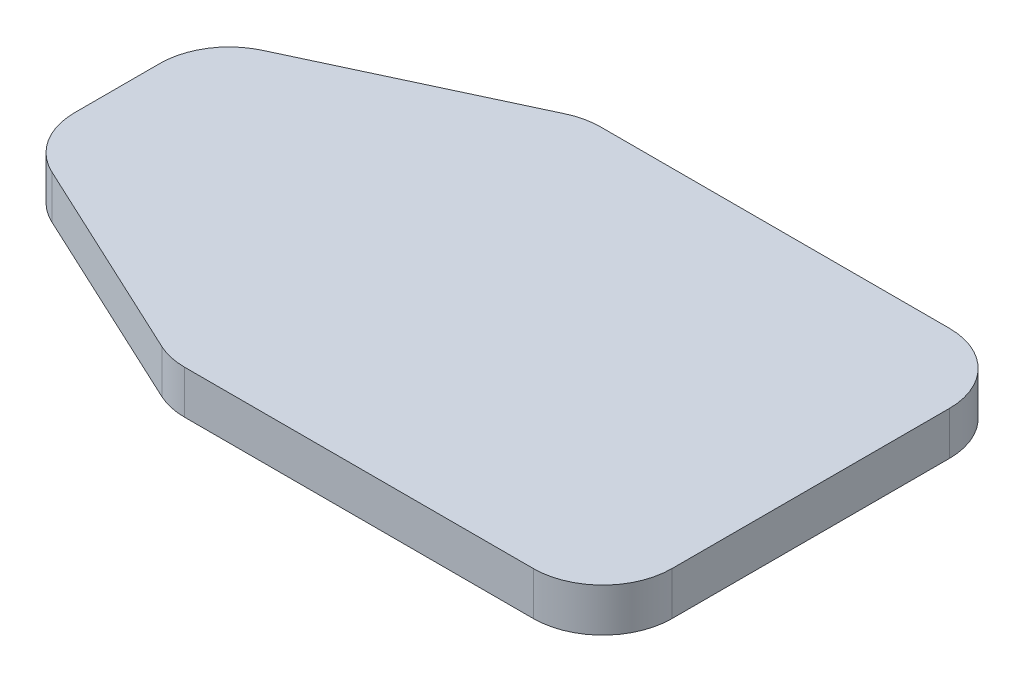
ISO-10303-21;
HEADER;
FILE_DESCRIPTION(('STEP AP214'),'2;1');
FILE_NAME('part.step','',(''),(''),'','','');
FILE_SCHEMA(('AUTOMOTIVE_DESIGN { 1 0 10303 214 1 1 1 1 }'));
ENDSEC;
DATA;
#1=APPLICATION_CONTEXT('core data for automotive mechanical design processes');
#2=APPLICATION_PROTOCOL_DEFINITION('international standard','automotive_design',2000,#1);
#3=PRODUCT_CONTEXT('',#1,'mechanical');
#4=PRODUCT('Part','Part','',(#3));
#5=PRODUCT_RELATED_PRODUCT_CATEGORY('part','',(#4));
#6=PRODUCT_DEFINITION_FORMATION('','',#4);
#7=PRODUCT_DEFINITION_CONTEXT('part definition',#1,'design');
#8=PRODUCT_DEFINITION('design','',#6,#7);
#9=PRODUCT_DEFINITION_SHAPE('','',#8);
#10=(LENGTH_UNIT() NAMED_UNIT(*) SI_UNIT(.MILLI.,.METRE.));
#11=(NAMED_UNIT(*) PLANE_ANGLE_UNIT() SI_UNIT($,.RADIAN.));
#12=(NAMED_UNIT(*) SI_UNIT($,.STERADIAN.) SOLID_ANGLE_UNIT());
#13=UNCERTAINTY_MEASURE_WITH_UNIT(LENGTH_MEASURE(1.E-05),#10,'distance_accuracy_value','');
#14=(GEOMETRIC_REPRESENTATION_CONTEXT(3) GLOBAL_UNCERTAINTY_ASSIGNED_CONTEXT((#13)) GLOBAL_UNIT_ASSIGNED_CONTEXT((#10,
#11,#12)) REPRESENTATION_CONTEXT('',''));
#15=CARTESIAN_POINT('',(0.,0.,0.));
#16=DIRECTION('',(0.,0.,1.));
#17=DIRECTION('',(1.,0.,0.));
#18=AXIS2_PLACEMENT_3D('',#15,#16,#17);
#19=CARTESIAN_POINT('',(-25.4,3.175,0.));
#20=DIRECTION('',(1.,0.,0.));
#21=DIRECTION('',(0.,0.,-1.));
#22=AXIS2_PLACEMENT_3D('',#19,#20,#21);
#23=PLANE('',#22);
#24=DIRECTION('',(0.,0.,1.));
#25=VECTOR('',#24,1.);
#26=CARTESIAN_POINT('',(-25.4,3.175,0.));
#27=LINE('',#26,#25);
#28=CARTESIAN_POINT('',(-25.4,3.175,-3.11473583901241));
#29=VERTEX_POINT('',#28);
#30=CARTESIAN_POINT('',(-25.4,3.175,3.1147358390124));
#31=VERTEX_POINT('',#30);
#32=EDGE_CURVE('E148',#29,#31,#27,.T.);
#33=ORIENTED_EDGE('',*,*,#32,.F.);
#34=DIRECTION('',(0.,-1.,0.));
#35=VECTOR('',#34,1.);
#36=CARTESIAN_POINT('',(-25.4,0.,-3.11473583901241));
#37=LINE('',#36,#35);
#38=CARTESIAN_POINT('',(-25.4,0.,-3.11473583901241));
#39=VERTEX_POINT('',#38);
#40=EDGE_CURVE('E186',#29,#39,#37,.T.);
#41=ORIENTED_EDGE('',*,*,#40,.T.);
#42=DIRECTION('',(0.,0.,1.));
#43=VECTOR('',#42,1.);
#44=CARTESIAN_POINT('',(-25.4,0.,0.));
#45=LINE('',#44,#43);
#46=CARTESIAN_POINT('',(-25.4,0.,3.1147358390124));
#47=VERTEX_POINT('',#46);
#48=EDGE_CURVE('E132',#39,#47,#45,.T.);
#49=ORIENTED_EDGE('',*,*,#48,.T.);
#50=DIRECTION('',(0.,-1.,0.));
#51=VECTOR('',#50,1.);
#52=CARTESIAN_POINT('',(-25.4,3.175,3.1147358390124));
#53=LINE('',#52,#51);
#54=EDGE_CURVE('E184',#47,#31,#53,.F.);
#55=ORIENTED_EDGE('',*,*,#54,.T.);
#56=EDGE_LOOP('',(#33,#41,#49,#55));
#57=FACE_BOUND('',#56,.T.);
#58=ADVANCED_FACE('F36',(#57),#23,.F.);
#59=CARTESIAN_POINT('',(-6.9757299270073,3.175,14.9479927007299));
#60=DIRECTION('',(0.422885465331124,0.,-0.906183139995265));
#61=DIRECTION('',(-0.906183139995265,0.,-0.422885465331124));
#62=AXIS2_PLACEMENT_3D('',#59,#60,#61);
#63=PLANE('',#62);
#64=DIRECTION('',(0.906183139995265,0.,0.422885465331124));
#65=VECTOR('',#64,1.);
#66=CARTESIAN_POINT('',(-6.9757299270073,3.175,14.9479927007299));
#67=LINE('',#66,#65);
#68=CARTESIAN_POINT('',(-22.4682581638821,3.175,7.71814619018835));
#69=VERTEX_POINT('',#68);
#70=CARTESIAN_POINT('',(-7.37126353319441,3.175,14.7634103511759));
#71=VERTEX_POINT('',#70);
#72=EDGE_CURVE('E202',#69,#71,#67,.T.);
#73=ORIENTED_EDGE('',*,*,#72,.F.);
#74=DIRECTION('',(0.,-1.,0.));
#75=VECTOR('',#74,1.);
#76=CARTESIAN_POINT('',(-22.4682581638821,3.175,7.71814619018835));
#77=LINE('',#76,#75);
#78=CARTESIAN_POINT('',(-22.4682581638821,0.,7.71814619018835));
#79=VERTEX_POINT('',#78);
#80=EDGE_CURVE('E11',#69,#79,#77,.T.);
#81=ORIENTED_EDGE('',*,*,#80,.T.);
#82=DIRECTION('',(0.906183139995265,0.,0.422885465331124));
#83=VECTOR('',#82,1.);
#84=CARTESIAN_POINT('',(-6.9757299270073,0.,14.9479927007299));
#85=LINE('',#84,#83);
#86=CARTESIAN_POINT('',(-7.37126353319441,0.,14.7634103511759));
#87=VERTEX_POINT('',#86);
#88=EDGE_CURVE('E205',#79,#87,#85,.T.);
#89=ORIENTED_EDGE('',*,*,#88,.T.);
#90=DIRECTION('',(0.,-1.,0.));
#91=VECTOR('',#90,1.);
#92=CARTESIAN_POINT('',(-7.37126353319441,3.175,14.7634103511759));
#93=LINE('',#92,#91);
#94=EDGE_CURVE('E44',#87,#71,#93,.F.);
#95=ORIENTED_EDGE('',*,*,#94,.T.);
#96=EDGE_LOOP('',(#73,#81,#89,#95));
#97=FACE_BOUND('',#96,.T.);
#98=ADVANCED_FACE('F201',(#97),#63,.F.);
#99=CARTESIAN_POINT('',(0.,3.175,15.24));
#100=DIRECTION('',(0.,0.,-1.));
#101=DIRECTION('',(-1.,0.,0.));
#102=AXIS2_PLACEMENT_3D('',#99,#100,#101);
#103=PLANE('',#102);
#104=DIRECTION('',(1.,0.,0.));
#105=VECTOR('',#104,1.);
#106=CARTESIAN_POINT('',(0.,0.,15.24));
#107=LINE('',#106,#105);
#108=CARTESIAN_POINT('',(-5.2230053693123,0.,15.24));
#109=VERTEX_POINT('',#108);
#110=CARTESIAN_POINT('',(20.32,0.,15.24));
#111=VERTEX_POINT('',#110);
#112=EDGE_CURVE('E220',#109,#111,#107,.T.);
#113=ORIENTED_EDGE('',*,*,#112,.T.);
#114=DIRECTION('',(0.,-1.,0.));
#115=VECTOR('',#114,1.);
#116=CARTESIAN_POINT('',(20.32,3.175,15.24));
#117=LINE('',#116,#115);
#118=CARTESIAN_POINT('',(20.32,3.175,15.24));
#119=VERTEX_POINT('',#118);
#120=EDGE_CURVE('E195',#111,#119,#117,.F.);
#121=ORIENTED_EDGE('',*,*,#120,.T.);
#122=DIRECTION('',(1.,0.,0.));
#123=VECTOR('',#122,1.);
#124=CARTESIAN_POINT('',(0.,3.175,15.24));
#125=LINE('',#124,#123);
#126=CARTESIAN_POINT('',(-5.2230053693123,3.175,15.24));
#127=VERTEX_POINT('',#126);
#128=EDGE_CURVE('E213',#127,#119,#125,.T.);
#129=ORIENTED_EDGE('',*,*,#128,.F.);
#130=DIRECTION('',(0.,-1.,0.));
#131=VECTOR('',#130,1.);
#132=CARTESIAN_POINT('',(-5.2230053693123,3.175,15.24));
#133=LINE('',#132,#131);
#134=EDGE_CURVE('E192',#127,#109,#133,.T.);
#135=ORIENTED_EDGE('',*,*,#134,.T.);
#136=EDGE_LOOP('',(#113,#121,#129,#135));
#137=FACE_BOUND('',#136,.T.);
#138=ADVANCED_FACE('F219',(#137),#103,.F.);
#139=CARTESIAN_POINT('',(25.4,3.175,0.));
#140=DIRECTION('',(1.,0.,0.));
#141=DIRECTION('',(0.,0.,-1.));
#142=AXIS2_PLACEMENT_3D('',#139,#140,#141);
#143=PLANE('',#142);
#144=DIRECTION('',(0.,0.,1.));
#145=VECTOR('',#144,1.);
#146=CARTESIAN_POINT('',(25.4,3.175,0.));
#147=LINE('',#146,#145);
#148=CARTESIAN_POINT('',(25.4,3.175,-10.16));
#149=VERTEX_POINT('',#148);
#150=CARTESIAN_POINT('',(25.4,3.175,10.16));
#151=VERTEX_POINT('',#150);
#152=EDGE_CURVE('E239',#149,#151,#147,.T.);
#153=ORIENTED_EDGE('',*,*,#152,.T.);
#154=DIRECTION('',(0.,-1.,0.));
#155=VECTOR('',#154,1.);
#156=CARTESIAN_POINT('',(25.4,0.,10.16));
#157=LINE('',#156,#155);
#158=CARTESIAN_POINT('',(25.4,0.,10.16));
#159=VERTEX_POINT('',#158);
#160=EDGE_CURVE('E189',#151,#159,#157,.T.);
#161=ORIENTED_EDGE('',*,*,#160,.T.);
#162=DIRECTION('',(0.,0.,1.));
#163=VECTOR('',#162,1.);
#164=CARTESIAN_POINT('',(25.4,0.,0.));
#165=LINE('',#164,#163);
#166=CARTESIAN_POINT('',(25.4,0.,-10.16));
#167=VERTEX_POINT('',#166);
#168=EDGE_CURVE('E223',#167,#159,#165,.T.);
#169=ORIENTED_EDGE('',*,*,#168,.F.);
#170=DIRECTION('',(0.,-1.,0.));
#171=VECTOR('',#170,1.);
#172=CARTESIAN_POINT('',(25.4,3.175,-10.16));
#173=LINE('',#172,#171);
#174=EDGE_CURVE('E58',#167,#149,#173,.F.);
#175=ORIENTED_EDGE('',*,*,#174,.T.);
#176=EDGE_LOOP('',(#153,#161,#169,#175));
#177=FACE_BOUND('',#176,.T.);
#178=ADVANCED_FACE('F274',(#177),#143,.T.);
#179=CARTESIAN_POINT('',(0.,3.175,-15.24));
#180=DIRECTION('',(0.,0.,-1.));
#181=DIRECTION('',(-1.,0.,0.));
#182=AXIS2_PLACEMENT_3D('',#179,#180,#181);
#183=PLANE('',#182);
#184=DIRECTION('',(1.,0.,0.));
#185=VECTOR('',#184,1.);
#186=CARTESIAN_POINT('',(0.,0.,-15.24));
#187=LINE('',#186,#185);
#188=CARTESIAN_POINT('',(-5.2230053693123,0.,-15.24));
#189=VERTEX_POINT('',#188);
#190=CARTESIAN_POINT('',(20.32,0.,-15.24));
#191=VERTEX_POINT('',#190);
#192=EDGE_CURVE('E149',#189,#191,#187,.T.);
#193=ORIENTED_EDGE('',*,*,#192,.F.);
#194=DIRECTION('',(0.,-1.,0.));
#195=VECTOR('',#194,1.);
#196=CARTESIAN_POINT('',(-5.2230053693123,3.175,-15.24));
#197=LINE('',#196,#195);
#198=CARTESIAN_POINT('',(-5.2230053693123,3.175,-15.24));
#199=VERTEX_POINT('',#198);
#200=EDGE_CURVE('E172',#189,#199,#197,.F.);
#201=ORIENTED_EDGE('',*,*,#200,.T.);
#202=DIRECTION('',(1.,0.,0.));
#203=VECTOR('',#202,1.);
#204=CARTESIAN_POINT('',(0.,3.175,-15.24));
#205=LINE('',#204,#203);
#206=CARTESIAN_POINT('',(20.32,3.175,-15.24));
#207=VERTEX_POINT('',#206);
#208=EDGE_CURVE('E158',#199,#207,#205,.T.);
#209=ORIENTED_EDGE('',*,*,#208,.T.);
#210=DIRECTION('',(0.,-1.,0.));
#211=VECTOR('',#210,1.);
#212=CARTESIAN_POINT('',(20.32,3.175,-15.24));
#213=LINE('',#212,#211);
#214=EDGE_CURVE('E169',#207,#191,#213,.T.);
#215=ORIENTED_EDGE('',*,*,#214,.T.);
#216=EDGE_LOOP('',(#193,#201,#209,#215));
#217=FACE_BOUND('',#216,.T.);
#218=ADVANCED_FACE('F232',(#217),#183,.T.);
#219=CARTESIAN_POINT('',(-6.9757299270073,3.175,-14.9479927007299));
#220=DIRECTION('',(-0.422885465331124,0.,-0.906183139995265));
#221=DIRECTION('',(-0.906183139995265,0.,0.422885465331124));
#222=AXIS2_PLACEMENT_3D('',#219,#220,#221);
#223=PLANE('',#222);
#224=DIRECTION('',(0.906183139995265,0.,-0.422885465331124));
#225=VECTOR('',#224,1.);
#226=CARTESIAN_POINT('',(-6.9757299270073,3.175,-14.9479927007299));
#227=LINE('',#226,#225);
#228=CARTESIAN_POINT('',(-22.4682581638821,3.175,-7.71814619018835));
#229=VERTEX_POINT('',#228);
#230=CARTESIAN_POINT('',(-7.37126353319441,3.175,-14.7634103511759));
#231=VERTEX_POINT('',#230);
#232=EDGE_CURVE('E154',#229,#231,#227,.T.);
#233=ORIENTED_EDGE('',*,*,#232,.T.);
#234=DIRECTION('',(0.,-1.,0.));
#235=VECTOR('',#234,1.);
#236=CARTESIAN_POINT('',(-7.37126353319441,3.175,-14.7634103511759));
#237=LINE('',#236,#235);
#238=CARTESIAN_POINT('',(-7.37126353319441,0.,-14.7634103511759));
#239=VERTEX_POINT('',#238);
#240=EDGE_CURVE('E147',#231,#239,#237,.T.);
#241=ORIENTED_EDGE('',*,*,#240,.T.);
#242=DIRECTION('',(0.906183139995265,0.,-0.422885465331124));
#243=VECTOR('',#242,1.);
#244=CARTESIAN_POINT('',(-6.9757299270073,0.,-14.9479927007299));
#245=LINE('',#244,#243);
#246=CARTESIAN_POINT('',(-22.4682581638821,0.,-7.71814619018835));
#247=VERTEX_POINT('',#246);
#248=EDGE_CURVE('E130',#247,#239,#245,.T.);
#249=ORIENTED_EDGE('',*,*,#248,.F.);
#250=DIRECTION('',(0.,-1.,0.));
#251=VECTOR('',#250,1.);
#252=CARTESIAN_POINT('',(-22.4682581638821,3.175,-7.71814619018835));
#253=LINE('',#252,#251);
#254=EDGE_CURVE('E144',#247,#229,#253,.F.);
#255=ORIENTED_EDGE('',*,*,#254,.T.);
#256=EDGE_LOOP('',(#233,#241,#249,#255));
#257=FACE_BOUND('',#256,.T.);
#258=ADVANCED_FACE('F143',(#257),#223,.T.);
#259=CARTESIAN_POINT('',(0.,3.175,0.));
#260=DIRECTION('',(0.,1.,0.));
#261=DIRECTION('',(0.,0.,1.));
#262=AXIS2_PLACEMENT_3D('',#259,#260,#261);
#263=PLANE('',#262);
#264=ORIENTED_EDGE('',*,*,#208,.F.);
#265=CARTESIAN_POINT('',(-5.2230053693123,3.175,-10.16));
#266=DIRECTION('',(0.,1.,0.));
#267=DIRECTION('',(0.,0.,1.));
#268=AXIS2_PLACEMENT_3D('',#265,#266,#267);
#269=CIRCLE('',#268,5.08);
#270=EDGE_CURVE('E182',#199,#231,#269,.T.);
#271=ORIENTED_EDGE('',*,*,#270,.T.);
#272=ORIENTED_EDGE('',*,*,#232,.F.);
#273=CARTESIAN_POINT('',(-20.32,3.175,-3.11473583901241));
#274=DIRECTION('',(0.,1.,0.));
#275=DIRECTION('',(0.,0.,1.));
#276=AXIS2_PLACEMENT_3D('',#273,#274,#275);
#277=CIRCLE('',#276,5.08);
#278=EDGE_CURVE('E153',#229,#29,#277,.T.);
#279=ORIENTED_EDGE('',*,*,#278,.T.);
#280=ORIENTED_EDGE('',*,*,#32,.T.);
#281=CARTESIAN_POINT('',(-20.32,3.175,3.1147358390124));
#282=DIRECTION('',(0.,1.,0.));
#283=DIRECTION('',(0.,0.,1.));
#284=AXIS2_PLACEMENT_3D('',#281,#282,#283);
#285=CIRCLE('',#284,5.08);
#286=EDGE_CURVE('E176',#31,#69,#285,.T.);
#287=ORIENTED_EDGE('',*,*,#286,.T.);
#288=ORIENTED_EDGE('',*,*,#72,.T.);
#289=CARTESIAN_POINT('',(-5.2230053693123,3.175,10.16));
#290=DIRECTION('',(0.,1.,0.));
#291=DIRECTION('',(0.,0.,1.));
#292=AXIS2_PLACEMENT_3D('',#289,#290,#291);
#293=CIRCLE('',#292,5.08);
#294=EDGE_CURVE('E174',#71,#127,#293,.T.);
#295=ORIENTED_EDGE('',*,*,#294,.T.);
#296=ORIENTED_EDGE('',*,*,#128,.T.);
#297=CARTESIAN_POINT('',(20.32,3.175,10.16));
#298=DIRECTION('',(0.,1.,0.));
#299=DIRECTION('',(0.,0.,1.));
#300=AXIS2_PLACEMENT_3D('',#297,#298,#299);
#301=CIRCLE('',#300,5.08);
#302=EDGE_CURVE('E51',#119,#151,#301,.T.);
#303=ORIENTED_EDGE('',*,*,#302,.T.);
#304=ORIENTED_EDGE('',*,*,#152,.F.);
#305=CARTESIAN_POINT('',(20.32,3.175,-10.16));
#306=DIRECTION('',(0.,1.,0.));
#307=DIRECTION('',(0.,0.,1.));
#308=AXIS2_PLACEMENT_3D('',#305,#306,#307);
#309=CIRCLE('',#308,5.08);
#310=EDGE_CURVE('E178',#149,#207,#309,.T.);
#311=ORIENTED_EDGE('',*,*,#310,.T.);
#312=EDGE_LOOP('',(#264,#271,#272,#279,#280,#287,#288,#295,#296,#303,#304,#311));
#313=FACE_BOUND('',#312,.T.);
#314=ADVANCED_FACE('F209',(#313),#263,.T.);
#315=CARTESIAN_POINT('',(0.,0.,0.));
#316=DIRECTION('',(0.,1.,0.));
#317=DIRECTION('',(0.,0.,1.));
#318=AXIS2_PLACEMENT_3D('',#315,#316,#317);
#319=PLANE('',#318);
#320=ORIENTED_EDGE('',*,*,#248,.T.);
#321=CARTESIAN_POINT('',(-5.2230053693123,0.,-10.16));
#322=DIRECTION('',(0.,1.,0.));
#323=DIRECTION('',(0.,0.,1.));
#324=AXIS2_PLACEMENT_3D('',#321,#322,#323);
#325=CIRCLE('',#324,5.08);
#326=EDGE_CURVE('E137',#239,#189,#325,.F.);
#327=ORIENTED_EDGE('',*,*,#326,.T.);
#328=ORIENTED_EDGE('',*,*,#192,.T.);
#329=CARTESIAN_POINT('',(20.32,0.,-10.16));
#330=DIRECTION('',(0.,1.,0.));
#331=DIRECTION('',(0.,0.,1.));
#332=AXIS2_PLACEMENT_3D('',#329,#330,#331);
#333=CIRCLE('',#332,5.08);
#334=EDGE_CURVE('E165',#191,#167,#333,.F.);
#335=ORIENTED_EDGE('',*,*,#334,.T.);
#336=ORIENTED_EDGE('',*,*,#168,.T.);
#337=CARTESIAN_POINT('',(20.32,0.,10.16));
#338=DIRECTION('',(0.,1.,0.));
#339=DIRECTION('',(0.,0.,1.));
#340=AXIS2_PLACEMENT_3D('',#337,#338,#339);
#341=CIRCLE('',#340,5.08);
#342=EDGE_CURVE('E138',#159,#111,#341,.F.);
#343=ORIENTED_EDGE('',*,*,#342,.T.);
#344=ORIENTED_EDGE('',*,*,#112,.F.);
#345=CARTESIAN_POINT('',(-5.2230053693123,0.,10.16));
#346=DIRECTION('',(0.,1.,0.));
#347=DIRECTION('',(0.,0.,1.));
#348=AXIS2_PLACEMENT_3D('',#345,#346,#347);
#349=CIRCLE('',#348,5.08);
#350=EDGE_CURVE('E156',#109,#87,#349,.F.);
#351=ORIENTED_EDGE('',*,*,#350,.T.);
#352=ORIENTED_EDGE('',*,*,#88,.F.);
#353=CARTESIAN_POINT('',(-20.32,0.,3.1147358390124));
#354=DIRECTION('',(0.,1.,0.));
#355=DIRECTION('',(0.,0.,1.));
#356=AXIS2_PLACEMENT_3D('',#353,#354,#355);
#357=CIRCLE('',#356,5.08);
#358=EDGE_CURVE('E163',#79,#47,#357,.F.);
#359=ORIENTED_EDGE('',*,*,#358,.T.);
#360=ORIENTED_EDGE('',*,*,#48,.F.);
#361=CARTESIAN_POINT('',(-20.32,0.,-3.11473583901241));
#362=DIRECTION('',(0.,1.,0.));
#363=DIRECTION('',(0.,0.,1.));
#364=AXIS2_PLACEMENT_3D('',#361,#362,#363);
#365=CIRCLE('',#364,5.08);
#366=EDGE_CURVE('E127',#39,#247,#365,.F.);
#367=ORIENTED_EDGE('',*,*,#366,.T.);
#368=EDGE_LOOP('',(#320,#327,#328,#335,#336,#343,#344,#351,#352,#359,#360,#367));
#369=FACE_BOUND('',#368,.T.);
#370=ADVANCED_FACE('F129',(#369),#319,.F.);
#371=CARTESIAN_POINT('',(-5.2230053693123,3.175,-10.16));
#372=DIRECTION('',(0.,-1.,0.));
#373=DIRECTION('',(0.,0.,-1.));
#374=AXIS2_PLACEMENT_3D('',#371,#372,#373);
#375=CYLINDRICAL_SURFACE('',#374,5.08);
#376=ORIENTED_EDGE('',*,*,#270,.F.);
#377=ORIENTED_EDGE('',*,*,#200,.F.);
#378=ORIENTED_EDGE('',*,*,#326,.F.);
#379=ORIENTED_EDGE('',*,*,#240,.F.);
#380=EDGE_LOOP('',(#376,#377,#378,#379));
#381=FACE_BOUND('',#380,.T.);
#382=ADVANCED_FACE('F237',(#381),#375,.T.);
#383=CARTESIAN_POINT('',(-20.32,3.175,-3.11473583901241));
#384=DIRECTION('',(0.,1.,0.));
#385=DIRECTION('',(0.,0.,1.));
#386=AXIS2_PLACEMENT_3D('',#383,#384,#385);
#387=CYLINDRICAL_SURFACE('',#386,5.08);
#388=ORIENTED_EDGE('',*,*,#278,.F.);
#389=ORIENTED_EDGE('',*,*,#254,.F.);
#390=ORIENTED_EDGE('',*,*,#366,.F.);
#391=ORIENTED_EDGE('',*,*,#40,.F.);
#392=EDGE_LOOP('',(#388,#389,#390,#391));
#393=FACE_BOUND('',#392,.T.);
#394=ADVANCED_FACE('F152',(#393),#387,.T.);
#395=CARTESIAN_POINT('',(20.32,3.175,10.16));
#396=DIRECTION('',(0.,1.,0.));
#397=DIRECTION('',(0.,0.,1.));
#398=AXIS2_PLACEMENT_3D('',#395,#396,#397);
#399=CYLINDRICAL_SURFACE('',#398,5.08);
#400=ORIENTED_EDGE('',*,*,#302,.F.);
#401=ORIENTED_EDGE('',*,*,#120,.F.);
#402=ORIENTED_EDGE('',*,*,#342,.F.);
#403=ORIENTED_EDGE('',*,*,#160,.F.);
#404=EDGE_LOOP('',(#400,#401,#402,#403));
#405=FACE_BOUND('',#404,.T.);
#406=ADVANCED_FACE('F254',(#405),#399,.T.);
#407=CARTESIAN_POINT('',(20.32,3.175,-10.16));
#408=DIRECTION('',(0.,-1.,0.));
#409=DIRECTION('',(0.,0.,-1.));
#410=AXIS2_PLACEMENT_3D('',#407,#408,#409);
#411=CYLINDRICAL_SURFACE('',#410,5.08);
#412=ORIENTED_EDGE('',*,*,#310,.F.);
#413=ORIENTED_EDGE('',*,*,#174,.F.);
#414=ORIENTED_EDGE('',*,*,#334,.F.);
#415=ORIENTED_EDGE('',*,*,#214,.F.);
#416=EDGE_LOOP('',(#412,#413,#414,#415));
#417=FACE_BOUND('',#416,.T.);
#418=ADVANCED_FACE('F249',(#417),#411,.T.);
#419=CARTESIAN_POINT('',(-20.32,3.175,3.1147358390124));
#420=DIRECTION('',(0.,-1.,0.));
#421=DIRECTION('',(0.,0.,-1.));
#422=AXIS2_PLACEMENT_3D('',#419,#420,#421);
#423=CYLINDRICAL_SURFACE('',#422,5.08);
#424=ORIENTED_EDGE('',*,*,#286,.F.);
#425=ORIENTED_EDGE('',*,*,#54,.F.);
#426=ORIENTED_EDGE('',*,*,#358,.F.);
#427=ORIENTED_EDGE('',*,*,#80,.F.);
#428=EDGE_LOOP('',(#424,#425,#426,#427));
#429=FACE_BOUND('',#428,.T.);
#430=ADVANCED_FACE('F247',(#429),#423,.T.);
#431=CARTESIAN_POINT('',(-5.2230053693123,3.175,10.16));
#432=DIRECTION('',(0.,-1.,0.));
#433=DIRECTION('',(0.,0.,-1.));
#434=AXIS2_PLACEMENT_3D('',#431,#432,#433);
#435=CYLINDRICAL_SURFACE('',#434,5.08);
#436=ORIENTED_EDGE('',*,*,#294,.F.);
#437=ORIENTED_EDGE('',*,*,#94,.F.);
#438=ORIENTED_EDGE('',*,*,#350,.F.);
#439=ORIENTED_EDGE('',*,*,#134,.F.);
#440=EDGE_LOOP('',(#436,#437,#438,#439));
#441=FACE_BOUND('',#440,.T.);
#442=ADVANCED_FACE('F38',(#441),#435,.T.);
#443=CLOSED_SHELL('',(#58,#98,#138,#178,#218,#258,#314,#370,#382,#394,#406,#418,#430,#442));
#444=MANIFOLD_SOLID_BREP('B2',#443);
#445=ADVANCED_BREP_SHAPE_REPRESENTATION('',(#18,#444),#14);
#446=SHAPE_DEFINITION_REPRESENTATION(#9,#445);
ENDSEC;
END-ISO-10303-21;
